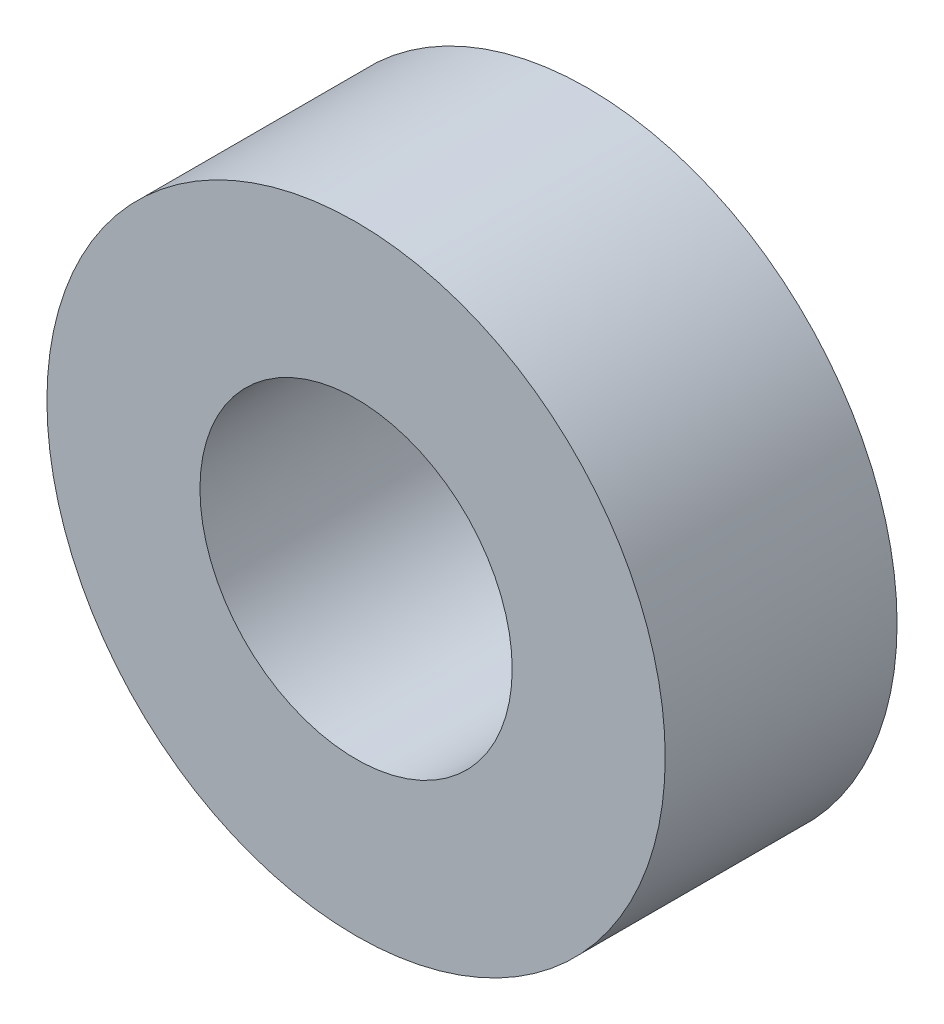
ISO-10303-21;
HEADER;
FILE_DESCRIPTION(('STEP AP214'),'2;1');
FILE_NAME('part.step','',(''),(''),'','','');
FILE_SCHEMA(('AUTOMOTIVE_DESIGN { 1 0 10303 214 1 1 1 1 }'));
ENDSEC;
DATA;
#1=APPLICATION_CONTEXT('core data for automotive mechanical design processes');
#2=APPLICATION_PROTOCOL_DEFINITION('international standard','automotive_design',2000,#1);
#3=PRODUCT_CONTEXT('',#1,'mechanical');
#4=PRODUCT('Part','Part','',(#3));
#5=PRODUCT_RELATED_PRODUCT_CATEGORY('part','',(#4));
#6=PRODUCT_DEFINITION_FORMATION('','',#4);
#7=PRODUCT_DEFINITION_CONTEXT('part definition',#1,'design');
#8=PRODUCT_DEFINITION('design','',#6,#7);
#9=PRODUCT_DEFINITION_SHAPE('','',#8);
#10=(LENGTH_UNIT() NAMED_UNIT(*) SI_UNIT(.MILLI.,.METRE.));
#11=(NAMED_UNIT(*) PLANE_ANGLE_UNIT() SI_UNIT($,.RADIAN.));
#12=(NAMED_UNIT(*) SI_UNIT($,.STERADIAN.) SOLID_ANGLE_UNIT());
#13=UNCERTAINTY_MEASURE_WITH_UNIT(LENGTH_MEASURE(1.E-05),#10,'distance_accuracy_value','');
#14=(GEOMETRIC_REPRESENTATION_CONTEXT(3) GLOBAL_UNCERTAINTY_ASSIGNED_CONTEXT((#13)) GLOBAL_UNIT_ASSIGNED_CONTEXT((#10,
#11,#12)) REPRESENTATION_CONTEXT('',''));
#15=CARTESIAN_POINT('',(0.,0.,0.));
#16=DIRECTION('',(0.,0.,1.));
#17=DIRECTION('',(1.,0.,0.));
#18=AXIS2_PLACEMENT_3D('',#15,#16,#17);
#19=CARTESIAN_POINT('',(0.,0.,9.525));
#20=DIRECTION('',(0.,0.,1.));
#21=DIRECTION('',(1.,0.,0.));
#22=AXIS2_PLACEMENT_3D('',#19,#20,#21);
#23=PLANE('',#22);
#24=CARTESIAN_POINT('',(0.,0.,9.525));
#25=DIRECTION('',(0.,0.,1.));
#26=DIRECTION('',(1.,0.,0.));
#27=AXIS2_PLACEMENT_3D('',#24,#25,#26);
#28=CIRCLE('',#27,12.7);
#29=CARTESIAN_POINT('',(12.7,0.,9.525));
#30=VERTEX_POINT('',#29);
#31=EDGE_CURVE('E10',#30,#30,#28,.T.);
#32=ORIENTED_EDGE('',*,*,#31,.T.);
#33=EDGE_LOOP('',(#32));
#34=FACE_BOUND('',#33,.T.);
#35=CARTESIAN_POINT('',(0.,0.,9.525));
#36=DIRECTION('',(0.,0.,1.));
#37=DIRECTION('',(1.,0.,0.));
#38=AXIS2_PLACEMENT_3D('',#35,#36,#37);
#39=CIRCLE('',#38,6.4135);
#40=CARTESIAN_POINT('',(6.4135,0.,9.525));
#41=VERTEX_POINT('',#40);
#42=EDGE_CURVE('E44',#41,#41,#39,.T.);
#43=ORIENTED_EDGE('',*,*,#42,.F.);
#44=EDGE_LOOP('',(#43));
#45=FACE_BOUND('',#44,.T.);
#46=ADVANCED_FACE('F33',(#34,#45),#23,.T.);
#47=CARTESIAN_POINT('',(0.,0.,0.));
#48=DIRECTION('',(0.,0.,1.));
#49=DIRECTION('',(1.,0.,0.));
#50=AXIS2_PLACEMENT_3D('',#47,#48,#49);
#51=PLANE('',#50);
#52=CARTESIAN_POINT('',(0.,0.,0.));
#53=DIRECTION('',(0.,0.,1.));
#54=DIRECTION('',(1.,0.,0.));
#55=AXIS2_PLACEMENT_3D('',#52,#53,#54);
#56=CIRCLE('',#55,12.7);
#57=CARTESIAN_POINT('',(12.7,0.,0.));
#58=VERTEX_POINT('',#57);
#59=EDGE_CURVE('E37',#58,#58,#56,.T.);
#60=ORIENTED_EDGE('',*,*,#59,.F.);
#61=EDGE_LOOP('',(#60));
#62=FACE_BOUND('',#61,.T.);
#63=CARTESIAN_POINT('',(0.,0.,0.));
#64=DIRECTION('',(0.,0.,1.));
#65=DIRECTION('',(1.,0.,0.));
#66=AXIS2_PLACEMENT_3D('',#63,#64,#65);
#67=CIRCLE('',#66,6.4135);
#68=CARTESIAN_POINT('',(6.4135,0.,0.));
#69=VERTEX_POINT('',#68);
#70=EDGE_CURVE('E46',#69,#69,#67,.T.);
#71=ORIENTED_EDGE('',*,*,#70,.T.);
#72=EDGE_LOOP('',(#71));
#73=FACE_BOUND('',#72,.T.);
#74=ADVANCED_FACE('F56',(#62,#73),#51,.F.);
#75=CARTESIAN_POINT('',(0.,0.,9.525));
#76=DIRECTION('',(0.,0.,-1.));
#77=DIRECTION('',(-1.,0.,0.));
#78=AXIS2_PLACEMENT_3D('',#75,#76,#77);
#79=CYLINDRICAL_SURFACE('',#78,12.7);
#80=ORIENTED_EDGE('',*,*,#31,.F.);
#81=EDGE_LOOP('',(#80));
#82=FACE_BOUND('',#81,.T.);
#83=ORIENTED_EDGE('',*,*,#59,.T.);
#84=EDGE_LOOP('',(#83));
#85=FACE_BOUND('',#84,.T.);
#86=ADVANCED_FACE('F35',(#82,#85),#79,.T.);
#87=CARTESIAN_POINT('',(0.,0.,9.525));
#88=DIRECTION('',(0.,0.,-1.));
#89=DIRECTION('',(-1.,0.,0.));
#90=AXIS2_PLACEMENT_3D('',#87,#88,#89);
#91=CYLINDRICAL_SURFACE('',#90,6.4135);
#92=ORIENTED_EDGE('',*,*,#42,.T.);
#93=EDGE_LOOP('',(#92));
#94=FACE_BOUND('',#93,.T.);
#95=ORIENTED_EDGE('',*,*,#70,.F.);
#96=EDGE_LOOP('',(#95));
#97=FACE_BOUND('',#96,.T.);
#98=ADVANCED_FACE('F52',(#94,#97),#91,.F.);
#99=CLOSED_SHELL('',(#46,#74,#86,#98));
#100=MANIFOLD_SOLID_BREP('B2',#99);
#101=ADVANCED_BREP_SHAPE_REPRESENTATION('',(#18,#100),#14);
#102=SHAPE_DEFINITION_REPRESENTATION(#9,#101);
ENDSEC;
END-ISO-10303-21;
